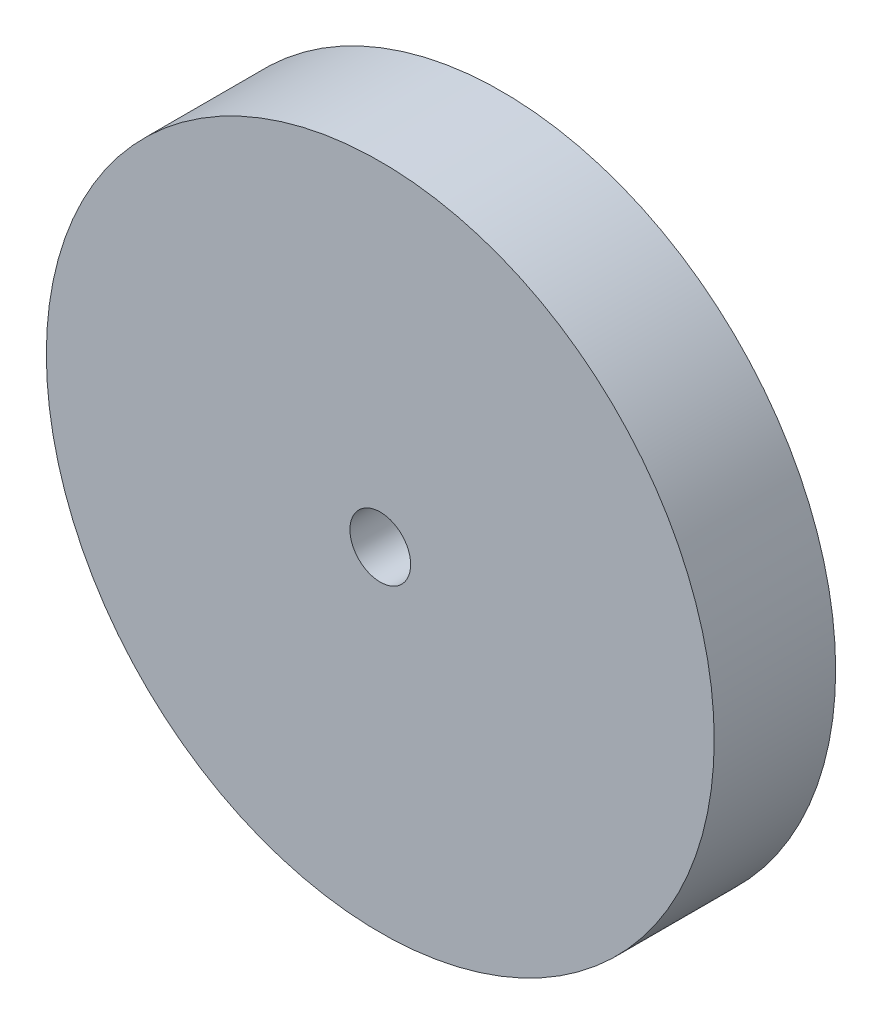
ISO-10303-21;
HEADER;
FILE_DESCRIPTION(('STEP AP214'),'2;1');
FILE_NAME('part.step','',(''),(''),'','','');
FILE_SCHEMA(('AUTOMOTIVE_DESIGN { 1 0 10303 214 1 1 1 1 }'));
ENDSEC;
DATA;
#1=APPLICATION_CONTEXT('core data for automotive mechanical design processes');
#2=APPLICATION_PROTOCOL_DEFINITION('international standard','automotive_design',2000,#1);
#3=PRODUCT_CONTEXT('',#1,'mechanical');
#4=PRODUCT('Part','Part','',(#3));
#5=PRODUCT_RELATED_PRODUCT_CATEGORY('part','',(#4));
#6=PRODUCT_DEFINITION_FORMATION('','',#4);
#7=PRODUCT_DEFINITION_CONTEXT('part definition',#1,'design');
#8=PRODUCT_DEFINITION('design','',#6,#7);
#9=PRODUCT_DEFINITION_SHAPE('','',#8);
#10=(LENGTH_UNIT() NAMED_UNIT(*) SI_UNIT(.MILLI.,.METRE.));
#11=(NAMED_UNIT(*) PLANE_ANGLE_UNIT() SI_UNIT($,.RADIAN.));
#12=(NAMED_UNIT(*) SI_UNIT($,.STERADIAN.) SOLID_ANGLE_UNIT());
#13=UNCERTAINTY_MEASURE_WITH_UNIT(LENGTH_MEASURE(1.E-05),#10,'distance_accuracy_value','');
#14=(GEOMETRIC_REPRESENTATION_CONTEXT(3) GLOBAL_UNCERTAINTY_ASSIGNED_CONTEXT((#13)) GLOBAL_UNIT_ASSIGNED_CONTEXT((#10,
#11,#12)) REPRESENTATION_CONTEXT('',''));
#15=CARTESIAN_POINT('',(0.,0.,0.));
#16=DIRECTION('',(0.,0.,1.));
#17=DIRECTION('',(1.,0.,0.));
#18=AXIS2_PLACEMENT_3D('',#15,#16,#17);
#19=CARTESIAN_POINT('',(0.,0.,4.));
#20=DIRECTION('',(0.,0.,-1.));
#21=DIRECTION('',(-1.,0.,0.));
#22=AXIS2_PLACEMENT_3D('',#19,#20,#21);
#23=CYLINDRICAL_SURFACE('',#22,11.);
#24=CARTESIAN_POINT('',(0.,0.,4.));
#25=DIRECTION('',(0.,0.,1.));
#26=DIRECTION('',(1.,0.,0.));
#27=AXIS2_PLACEMENT_3D('',#24,#25,#26);
#28=CIRCLE('',#27,11.);
#29=CARTESIAN_POINT('',(11.,0.,4.));
#30=VERTEX_POINT('',#29);
#31=EDGE_CURVE('E10',#30,#30,#28,.T.);
#32=ORIENTED_EDGE('',*,*,#31,.F.);
#33=EDGE_LOOP('',(#32));
#34=FACE_BOUND('',#33,.T.);
#35=CARTESIAN_POINT('',(0.,0.,0.));
#36=DIRECTION('',(0.,0.,1.));
#37=DIRECTION('',(1.,0.,0.));
#38=AXIS2_PLACEMENT_3D('',#35,#36,#37);
#39=CIRCLE('',#38,11.);
#40=CARTESIAN_POINT('',(11.,0.,0.));
#41=VERTEX_POINT('',#40);
#42=EDGE_CURVE('E44',#41,#41,#39,.T.);
#43=ORIENTED_EDGE('',*,*,#42,.T.);
#44=EDGE_LOOP('',(#43));
#45=FACE_BOUND('',#44,.T.);
#46=ADVANCED_FACE('F41',(#34,#45),#23,.T.);
#47=CARTESIAN_POINT('',(0.,0.,4.));
#48=DIRECTION('',(0.,0.,1.));
#49=DIRECTION('',(1.,0.,0.));
#50=AXIS2_PLACEMENT_3D('',#47,#48,#49);
#51=PLANE('',#50);
#52=CARTESIAN_POINT('',(0.,0.,4.));
#53=DIRECTION('',(0.,0.,1.));
#54=DIRECTION('',(1.,0.,0.));
#55=AXIS2_PLACEMENT_3D('',#52,#53,#54);
#56=CIRCLE('',#55,1.);
#57=CARTESIAN_POINT('',(1.,0.,4.));
#58=VERTEX_POINT('',#57);
#59=EDGE_CURVE('E55',#58,#58,#56,.T.);
#60=ORIENTED_EDGE('',*,*,#59,.F.);
#61=EDGE_LOOP('',(#60));
#62=FACE_BOUND('',#61,.T.);
#63=ORIENTED_EDGE('',*,*,#31,.T.);
#64=EDGE_LOOP('',(#63));
#65=FACE_BOUND('',#64,.T.);
#66=ADVANCED_FACE('F72',(#62,#65),#51,.T.);
#67=CARTESIAN_POINT('',(0.,0.,0.));
#68=DIRECTION('',(0.,0.,1.));
#69=DIRECTION('',(1.,0.,0.));
#70=AXIS2_PLACEMENT_3D('',#67,#68,#69);
#71=PLANE('',#70);
#72=CARTESIAN_POINT('',(0.,0.,0.));
#73=DIRECTION('',(0.,0.,1.));
#74=DIRECTION('',(1.,0.,0.));
#75=AXIS2_PLACEMENT_3D('',#72,#73,#74);
#76=CIRCLE('',#75,1.);
#77=CARTESIAN_POINT('',(1.,0.,0.));
#78=VERTEX_POINT('',#77);
#79=EDGE_CURVE('E53',#78,#78,#76,.T.);
#80=ORIENTED_EDGE('',*,*,#79,.T.);
#81=EDGE_LOOP('',(#80));
#82=FACE_BOUND('',#81,.T.);
#83=ORIENTED_EDGE('',*,*,#42,.F.);
#84=EDGE_LOOP('',(#83));
#85=FACE_BOUND('',#84,.T.);
#86=ADVANCED_FACE('F63',(#82,#85),#71,.F.);
#87=CARTESIAN_POINT('',(0.,0.,0.));
#88=DIRECTION('',(0.,0.,1.));
#89=DIRECTION('',(1.,0.,0.));
#90=AXIS2_PLACEMENT_3D('',#87,#88,#89);
#91=CYLINDRICAL_SURFACE('',#90,1.);
#92=ORIENTED_EDGE('',*,*,#79,.F.);
#93=EDGE_LOOP('',(#92));
#94=FACE_BOUND('',#93,.T.);
#95=ORIENTED_EDGE('',*,*,#59,.T.);
#96=EDGE_LOOP('',(#95));
#97=FACE_BOUND('',#96,.T.);
#98=ADVANCED_FACE('F66',(#94,#97),#91,.F.);
#99=CLOSED_SHELL('',(#46,#66,#86,#98));
#100=MANIFOLD_SOLID_BREP('B2',#99);
#101=ADVANCED_BREP_SHAPE_REPRESENTATION('',(#18,#100),#14);
#102=SHAPE_DEFINITION_REPRESENTATION(#9,#101);
ENDSEC;
END-ISO-10303-21;
